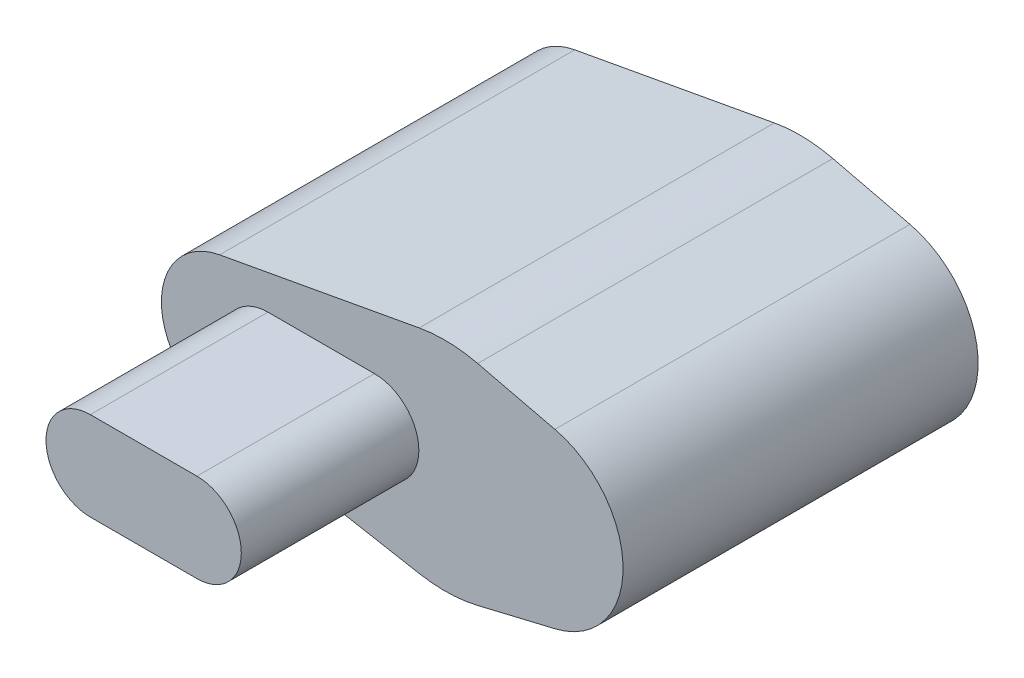
ISO-10303-21;
HEADER;
FILE_DESCRIPTION(('STEP AP214'),'2;1');
FILE_NAME('part.step','',(''),(''),'','','');
FILE_SCHEMA(('AUTOMOTIVE_DESIGN { 1 0 10303 214 1 1 1 1 }'));
ENDSEC;
DATA;
#1=APPLICATION_CONTEXT('core data for automotive mechanical design processes');
#2=APPLICATION_PROTOCOL_DEFINITION('international standard','automotive_design',2000,#1);
#3=PRODUCT_CONTEXT('',#1,'mechanical');
#4=PRODUCT('Part','Part','',(#3));
#5=PRODUCT_RELATED_PRODUCT_CATEGORY('part','',(#4));
#6=PRODUCT_DEFINITION_FORMATION('','',#4);
#7=PRODUCT_DEFINITION_CONTEXT('part definition',#1,'design');
#8=PRODUCT_DEFINITION('design','',#6,#7);
#9=PRODUCT_DEFINITION_SHAPE('','',#8);
#10=(LENGTH_UNIT() NAMED_UNIT(*) SI_UNIT(.MILLI.,.METRE.));
#11=(NAMED_UNIT(*) PLANE_ANGLE_UNIT() SI_UNIT($,.RADIAN.));
#12=(NAMED_UNIT(*) SI_UNIT($,.STERADIAN.) SOLID_ANGLE_UNIT());
#13=UNCERTAINTY_MEASURE_WITH_UNIT(LENGTH_MEASURE(1.E-05),#10,'distance_accuracy_value','');
#14=(GEOMETRIC_REPRESENTATION_CONTEXT(3) GLOBAL_UNCERTAINTY_ASSIGNED_CONTEXT((#13)) GLOBAL_UNIT_ASSIGNED_CONTEXT((#10,
#11,#12)) REPRESENTATION_CONTEXT('',''));
#15=CARTESIAN_POINT('',(0.,0.,0.));
#16=DIRECTION('',(0.,0.,1.));
#17=DIRECTION('',(1.,0.,0.));
#18=AXIS2_PLACEMENT_3D('',#15,#16,#17);
#19=CARTESIAN_POINT('',(-150.,0.,-16.));
#20=DIRECTION('',(0.,0.,-1.));
#21=DIRECTION('',(-1.,0.,0.));
#22=AXIS2_PLACEMENT_3D('',#19,#20,#21);
#23=PLANE('',#22);
#24=CARTESIAN_POINT('',(-150.,0.,-16.));
#25=DIRECTION('',(0.,0.,-1.));
#26=DIRECTION('',(-1.,0.,0.));
#27=AXIS2_PLACEMENT_3D('',#24,#25,#26);
#28=CIRCLE('',#27,28.);
#29=CARTESIAN_POINT('',(-178.,0.,-16.));
#30=VERTEX_POINT('',#29);
#31=EDGE_CURVE('E340',#30,#30,#28,.T.);
#32=ORIENTED_EDGE('',*,*,#31,.T.);
#33=EDGE_LOOP('',(#32));
#34=FACE_BOUND('',#33,.T.);
#35=CARTESIAN_POINT('',(-150.,0.,-16.));
#36=DIRECTION('',(0.,0.,-1.));
#37=DIRECTION('',(-1.,0.,0.));
#38=AXIS2_PLACEMENT_3D('',#35,#36,#37);
#39=CIRCLE('',#38,20.);
#40=CARTESIAN_POINT('',(-170.,0.,-16.));
#41=VERTEX_POINT('',#40);
#42=EDGE_CURVE('E331',#41,#41,#39,.T.);
#43=ORIENTED_EDGE('',*,*,#42,.F.);
#44=EDGE_LOOP('',(#43));
#45=FACE_BOUND('',#44,.T.);
#46=ADVANCED_FACE('F33',(#34,#45),#23,.T.);
#47=CARTESIAN_POINT('',(-80.,-224.819142690181,0.));
#48=DIRECTION('',(0.,0.,1.));
#49=DIRECTION('',(1.,0.,0.));
#50=AXIS2_PLACEMENT_3D('',#47,#48,#49);
#51=PLANE('',#50);
#52=DIRECTION('',(0.972650901363,0.232271875348144,0.));
#53=VECTOR('',#52,1.);
#54=CARTESIAN_POINT('',(-114.861405129302,-78.8351441067433,0.));
#55=LINE('',#54,#53);
#56=CARTESIAN_POINT('',(-31.8445005849701,-59.0104648954366,0.));
#57=VERTEX_POINT('',#56);
#58=CARTESIAN_POINT('',(11.6135937674072,-48.63254506815,0.));
#59=VERTEX_POINT('',#58);
#60=EDGE_CURVE('E173',#57,#59,#55,.T.);
#61=ORIENTED_EDGE('',*,*,#60,.F.);
#62=CARTESIAN_POINT('',(-50.4262506128216,18.8016072136034,0.));
#63=DIRECTION('',(0.,0.,1.));
#64=DIRECTION('',(1.,0.,0.));
#65=AXIS2_PLACEMENT_3D('',#62,#63,#64);
#66=CIRCLE('',#65,80.);
#67=CARTESIAN_POINT('',(-64.8139971783994,-59.8939628571745,0.));
#68=VERTEX_POINT('',#67);
#69=EDGE_CURVE('E193',#57,#68,#66,.F.);
#70=ORIENTED_EDGE('',*,*,#69,.T.);
#71=DIRECTION('',(-0.983694625884723,0.179846832069722,0.));
#72=VECTOR('',#71,1.);
#73=CARTESIAN_POINT('',(-50.331177516289,-62.541826500147,0.));
#74=LINE('',#73,#72);
#75=CARTESIAN_POINT('',(-177.193873282789,-39.347785035389,0.));
#76=VERTEX_POINT('',#75);
#77=EDGE_CURVE('E171',#68,#76,#74,.T.);
#78=ORIENTED_EDGE('',*,*,#77,.T.);
#79=CARTESIAN_POINT('',(-170.,0.,0.));
#80=DIRECTION('',(0.,0.,1.));
#81=DIRECTION('',(1.,0.,0.));
#82=AXIS2_PLACEMENT_3D('',#79,#80,#81);
#83=CIRCLE('',#82,40.);
#84=CARTESIAN_POINT('',(-177.193873282789,39.3477850353889,0.));
#85=VERTEX_POINT('',#84);
#86=EDGE_CURVE('E168',#85,#76,#83,.T.);
#87=ORIENTED_EDGE('',*,*,#86,.F.);
#88=DIRECTION('',(-0.983694625884723,-0.179846832069722,0.));
#89=VECTOR('',#88,1.);
#90=CARTESIAN_POINT('',(-129.878647990281,47.9983287647189,0.));
#91=LINE('',#90,#89);
#92=CARTESIAN_POINT('',(-64.8139971783996,59.8939628571745,0.));
#93=VERTEX_POINT('',#92);
#94=EDGE_CURVE('E145',#93,#85,#91,.T.);
#95=ORIENTED_EDGE('',*,*,#94,.F.);
#96=CARTESIAN_POINT('',(-50.4262506128218,-18.8016072136034,0.));
#97=DIRECTION('',(0.,0.,1.));
#98=DIRECTION('',(1.,0.,0.));
#99=AXIS2_PLACEMENT_3D('',#96,#97,#98);
#100=CIRCLE('',#99,80.);
#101=CARTESIAN_POINT('',(-31.8445005849702,59.0104648954366,0.));
#102=VERTEX_POINT('',#101);
#103=EDGE_CURVE('E191',#93,#102,#100,.F.);
#104=ORIENTED_EDGE('',*,*,#103,.T.);
#105=DIRECTION('',(0.972650901363,-0.232271875348144,0.));
#106=VECTOR('',#105,1.);
#107=CARTESIAN_POINT('',(-13.2793714834448,54.5770578565401,0.));
#108=LINE('',#107,#106);
#109=CARTESIAN_POINT('',(11.6135937674072,48.63254506815,0.));
#110=VERTEX_POINT('',#109);
#111=EDGE_CURVE('E143',#102,#110,#108,.T.);
#112=ORIENTED_EDGE('',*,*,#111,.T.);
#113=CARTESIAN_POINT('',(0.,0.,0.));
#114=DIRECTION('',(0.,0.,1.));
#115=DIRECTION('',(1.,0.,0.));
#116=AXIS2_PLACEMENT_3D('',#113,#114,#115);
#117=CIRCLE('',#116,50.);
#118=EDGE_CURVE('E154',#59,#110,#117,.T.);
#119=ORIENTED_EDGE('',*,*,#118,.F.);
#120=EDGE_LOOP('',(#61,#70,#78,#87,#95,#104,#112,#119));
#121=FACE_BOUND('',#120,.T.);
#122=CARTESIAN_POINT('',(0.,0.,0.));
#123=DIRECTION('',(0.,0.,-1.));
#124=DIRECTION('',(-1.,0.,0.));
#125=AXIS2_PLACEMENT_3D('',#122,#123,#124);
#126=CIRCLE('',#125,25.);
#127=CARTESIAN_POINT('',(-25.,0.,0.));
#128=VERTEX_POINT('',#127);
#129=EDGE_CURVE('E348',#128,#128,#126,.T.);
#130=ORIENTED_EDGE('',*,*,#129,.F.);
#131=EDGE_LOOP('',(#130));
#132=FACE_BOUND('',#131,.T.);
#133=CARTESIAN_POINT('',(-150.,0.,0.));
#134=DIRECTION('',(0.,0.,1.));
#135=DIRECTION('',(1.,0.,0.));
#136=AXIS2_PLACEMENT_3D('',#133,#134,#135);
#137=CIRCLE('',#136,25.);
#138=CARTESIAN_POINT('',(-125.,0.,0.));
#139=VERTEX_POINT('',#138);
#140=EDGE_CURVE('E41',#139,#139,#137,.F.);
#141=ORIENTED_EDGE('',*,*,#140,.F.);
#142=EDGE_LOOP('',(#141));
#143=FACE_BOUND('',#142,.T.);
#144=ADVANCED_FACE('F210',(#121,#132,#143),#51,.F.);
#145=CARTESIAN_POINT('',(-80.,-224.819142690181,200.));
#146=DIRECTION('',(0.,0.,1.));
#147=DIRECTION('',(1.,0.,0.));
#148=AXIS2_PLACEMENT_3D('',#145,#146,#147);
#149=PLANE('',#148);
#150=DIRECTION('',(-0.983694625884723,0.179846832069722,0.));
#151=VECTOR('',#150,1.);
#152=CARTESIAN_POINT('',(-50.331177516289,-62.541826500147,200.));
#153=LINE('',#152,#151);
#154=CARTESIAN_POINT('',(-64.8139971783994,-59.8939628571745,200.));
#155=VERTEX_POINT('',#154);
#156=CARTESIAN_POINT('',(-177.193873282789,-39.347785035389,200.));
#157=VERTEX_POINT('',#156);
#158=EDGE_CURVE('E159',#155,#157,#153,.T.);
#159=ORIENTED_EDGE('',*,*,#158,.F.);
#160=CARTESIAN_POINT('',(-50.4262506128216,18.8016072136034,200.));
#161=DIRECTION('',(0.,0.,1.));
#162=DIRECTION('',(1.,0.,0.));
#163=AXIS2_PLACEMENT_3D('',#160,#161,#162);
#164=CIRCLE('',#163,80.);
#165=CARTESIAN_POINT('',(-31.8445005849701,-59.0104648954366,200.));
#166=VERTEX_POINT('',#165);
#167=EDGE_CURVE('E199',#155,#166,#164,.T.);
#168=ORIENTED_EDGE('',*,*,#167,.T.);
#169=DIRECTION('',(0.972650901363,0.232271875348144,0.));
#170=VECTOR('',#169,1.);
#171=CARTESIAN_POINT('',(-114.861405129302,-78.8351441067433,200.));
#172=LINE('',#171,#170);
#173=CARTESIAN_POINT('',(11.6135937674072,-48.63254506815,200.));
#174=VERTEX_POINT('',#173);
#175=EDGE_CURVE('E161',#166,#174,#172,.T.);
#176=ORIENTED_EDGE('',*,*,#175,.T.);
#177=CARTESIAN_POINT('',(0.,0.,200.));
#178=DIRECTION('',(0.,0.,1.));
#179=DIRECTION('',(1.,0.,0.));
#180=AXIS2_PLACEMENT_3D('',#177,#178,#179);
#181=CIRCLE('',#180,50.);
#182=CARTESIAN_POINT('',(11.6135937674072,48.63254506815,200.));
#183=VERTEX_POINT('',#182);
#184=EDGE_CURVE('E163',#174,#183,#181,.T.);
#185=ORIENTED_EDGE('',*,*,#184,.T.);
#186=DIRECTION('',(0.972650901363,-0.232271875348144,0.));
#187=VECTOR('',#186,1.);
#188=CARTESIAN_POINT('',(-13.2793714834448,54.5770578565401,200.));
#189=LINE('',#188,#187);
#190=CARTESIAN_POINT('',(-31.8445005849702,59.0104648954366,200.));
#191=VERTEX_POINT('',#190);
#192=EDGE_CURVE('E151',#191,#183,#189,.T.);
#193=ORIENTED_EDGE('',*,*,#192,.F.);
#194=CARTESIAN_POINT('',(-50.4262506128218,-18.8016072136034,200.));
#195=DIRECTION('',(0.,0.,1.));
#196=DIRECTION('',(1.,0.,0.));
#197=AXIS2_PLACEMENT_3D('',#194,#195,#196);
#198=CIRCLE('',#197,80.);
#199=CARTESIAN_POINT('',(-64.8139971783996,59.8939628571745,200.));
#200=VERTEX_POINT('',#199);
#201=EDGE_CURVE('E197',#191,#200,#198,.T.);
#202=ORIENTED_EDGE('',*,*,#201,.T.);
#203=DIRECTION('',(-0.983694625884723,-0.179846832069722,0.));
#204=VECTOR('',#203,1.);
#205=CARTESIAN_POINT('',(-129.878647990281,47.9983287647189,200.));
#206=LINE('',#205,#204);
#207=CARTESIAN_POINT('',(-177.193873282789,39.3477850353889,200.));
#208=VERTEX_POINT('',#207);
#209=EDGE_CURVE('E153',#200,#208,#206,.T.);
#210=ORIENTED_EDGE('',*,*,#209,.T.);
#211=CARTESIAN_POINT('',(-170.,0.,200.));
#212=DIRECTION('',(0.,0.,1.));
#213=DIRECTION('',(1.,0.,0.));
#214=AXIS2_PLACEMENT_3D('',#211,#212,#213);
#215=CIRCLE('',#214,40.);
#216=EDGE_CURVE('E156',#208,#157,#215,.T.);
#217=ORIENTED_EDGE('',*,*,#216,.T.);
#218=EDGE_LOOP('',(#159,#168,#176,#185,#193,#202,#210,#217));
#219=FACE_BOUND('',#218,.T.);
#220=DIRECTION('',(1.,0.,0.));
#221=VECTOR('',#220,1.);
#222=CARTESIAN_POINT('',(-80.0000000000002,-25.,200.));
#223=LINE('',#222,#221);
#224=CARTESIAN_POINT('',(-150.,-25.0000000000001,200.));
#225=VERTEX_POINT('',#224);
#226=CARTESIAN_POINT('',(-90.,-25.,200.));
#227=VERTEX_POINT('',#226);
#228=EDGE_CURVE('E48',#225,#227,#223,.T.);
#229=ORIENTED_EDGE('',*,*,#228,.F.);
#230=CARTESIAN_POINT('',(-150.,0.,200.));
#231=DIRECTION('',(0.,0.,1.));
#232=DIRECTION('',(1.,0.,0.));
#233=AXIS2_PLACEMENT_3D('',#230,#231,#232);
#234=CIRCLE('',#233,25.);
#235=CARTESIAN_POINT('',(-150.,25.,200.));
#236=VERTEX_POINT('',#235);
#237=EDGE_CURVE('E142',#236,#225,#234,.T.);
#238=ORIENTED_EDGE('',*,*,#237,.F.);
#239=DIRECTION('',(1.,0.,0.));
#240=VECTOR('',#239,1.);
#241=CARTESIAN_POINT('',(-80.,25.,200.));
#242=LINE('',#241,#240);
#243=CARTESIAN_POINT('',(-90.,25.,200.));
#244=VERTEX_POINT('',#243);
#245=EDGE_CURVE('E139',#236,#244,#242,.T.);
#246=ORIENTED_EDGE('',*,*,#245,.T.);
#247=CARTESIAN_POINT('',(-90.,0.,200.));
#248=DIRECTION('',(0.,0.,1.));
#249=DIRECTION('',(1.,0.,0.));
#250=AXIS2_PLACEMENT_3D('',#247,#248,#249);
#251=CIRCLE('',#250,25.);
#252=EDGE_CURVE('E53',#227,#244,#251,.T.);
#253=ORIENTED_EDGE('',*,*,#252,.F.);
#254=EDGE_LOOP('',(#229,#238,#246,#253));
#255=FACE_BOUND('',#254,.T.);
#256=ADVANCED_FACE('F212',(#219,#255),#149,.T.);
#257=CARTESIAN_POINT('',(-13.2793714834448,54.5770578565401,200.));
#258=DIRECTION('',(0.232271875348144,0.972650901363,0.));
#259=DIRECTION('',(-0.972650901363,0.232271875348144,0.));
#260=AXIS2_PLACEMENT_3D('',#257,#258,#259);
#261=PLANE('',#260);
#262=ORIENTED_EDGE('',*,*,#111,.F.);
#263=DIRECTION('',(0.,0.,-1.));
#264=VECTOR('',#263,1.);
#265=CARTESIAN_POINT('',(-31.8445005849702,59.0104648954366,200.));
#266=LINE('',#265,#264);
#267=EDGE_CURVE('E204',#102,#191,#266,.F.);
#268=ORIENTED_EDGE('',*,*,#267,.T.);
#269=ORIENTED_EDGE('',*,*,#192,.T.);
#270=DIRECTION('',(0.,0.,-1.));
#271=VECTOR('',#270,1.);
#272=CARTESIAN_POINT('',(11.6135937674072,48.63254506815,200.));
#273=LINE('',#272,#271);
#274=EDGE_CURVE('E165',#183,#110,#273,.T.);
#275=ORIENTED_EDGE('',*,*,#274,.T.);
#276=EDGE_LOOP('',(#262,#268,#269,#275));
#277=FACE_BOUND('',#276,.T.);
#278=ADVANCED_FACE('F219',(#277),#261,.T.);
#279=CARTESIAN_POINT('',(-129.878647990281,47.9983287647189,200.));
#280=DIRECTION('',(0.179846832069722,-0.983694625884723,0.));
#281=DIRECTION('',(0.983694625884723,0.179846832069722,0.));
#282=AXIS2_PLACEMENT_3D('',#279,#280,#281);
#283=PLANE('',#282);
#284=ORIENTED_EDGE('',*,*,#209,.F.);
#285=DIRECTION('',(0.,0.,-1.));
#286=VECTOR('',#285,1.);
#287=CARTESIAN_POINT('',(-64.8139971783996,59.8939628571745,0.));
#288=LINE('',#287,#286);
#289=EDGE_CURVE('E201',#200,#93,#288,.T.);
#290=ORIENTED_EDGE('',*,*,#289,.T.);
#291=ORIENTED_EDGE('',*,*,#94,.T.);
#292=DIRECTION('',(0.,0.,-1.));
#293=VECTOR('',#292,1.);
#294=CARTESIAN_POINT('',(-177.193873282789,39.3477850353889,200.));
#295=LINE('',#294,#293);
#296=EDGE_CURVE('E185',#208,#85,#295,.T.);
#297=ORIENTED_EDGE('',*,*,#296,.F.);
#298=EDGE_LOOP('',(#284,#290,#291,#297));
#299=FACE_BOUND('',#298,.T.);
#300=ADVANCED_FACE('F244',(#299),#283,.F.);
#301=CARTESIAN_POINT('',(-170.,0.,200.));
#302=DIRECTION('',(0.,0.,-1.));
#303=DIRECTION('',(-1.,0.,0.));
#304=AXIS2_PLACEMENT_3D('',#301,#302,#303);
#305=CYLINDRICAL_SURFACE('',#304,40.);
#306=ORIENTED_EDGE('',*,*,#86,.T.);
#307=DIRECTION('',(0.,0.,-1.));
#308=VECTOR('',#307,1.);
#309=CARTESIAN_POINT('',(-177.193873282789,-39.347785035389,200.));
#310=LINE('',#309,#308);
#311=EDGE_CURVE('E182',#157,#76,#310,.T.);
#312=ORIENTED_EDGE('',*,*,#311,.F.);
#313=ORIENTED_EDGE('',*,*,#216,.F.);
#314=ORIENTED_EDGE('',*,*,#296,.T.);
#315=EDGE_LOOP('',(#306,#312,#313,#314));
#316=FACE_BOUND('',#315,.T.);
#317=ADVANCED_FACE('F240',(#316),#305,.T.);
#318=CARTESIAN_POINT('',(-50.331177516289,-62.541826500147,200.));
#319=DIRECTION('',(-0.179846832069722,-0.983694625884723,0.));
#320=DIRECTION('',(0.983694625884723,-0.179846832069722,0.));
#321=AXIS2_PLACEMENT_3D('',#318,#319,#320);
#322=PLANE('',#321);
#323=ORIENTED_EDGE('',*,*,#77,.F.);
#324=DIRECTION('',(0.,0.,-1.));
#325=VECTOR('',#324,1.);
#326=CARTESIAN_POINT('',(-64.8139971783994,-59.8939628571745,200.));
#327=LINE('',#326,#325);
#328=EDGE_CURVE('E195',#68,#155,#327,.F.);
#329=ORIENTED_EDGE('',*,*,#328,.T.);
#330=ORIENTED_EDGE('',*,*,#158,.T.);
#331=ORIENTED_EDGE('',*,*,#311,.T.);
#332=EDGE_LOOP('',(#323,#329,#330,#331));
#333=FACE_BOUND('',#332,.T.);
#334=ADVANCED_FACE('F236',(#333),#322,.T.);
#335=CARTESIAN_POINT('',(-114.861405129302,-78.8351441067433,200.));
#336=DIRECTION('',(-0.232271875348144,0.972650901363,0.));
#337=DIRECTION('',(-0.972650901363,-0.232271875348144,0.));
#338=AXIS2_PLACEMENT_3D('',#335,#336,#337);
#339=PLANE('',#338);
#340=ORIENTED_EDGE('',*,*,#175,.F.);
#341=DIRECTION('',(0.,0.,-1.));
#342=VECTOR('',#341,1.);
#343=CARTESIAN_POINT('',(-31.8445005849701,-59.0104648954366,0.));
#344=LINE('',#343,#342);
#345=EDGE_CURVE('E188',#166,#57,#344,.T.);
#346=ORIENTED_EDGE('',*,*,#345,.T.);
#347=ORIENTED_EDGE('',*,*,#60,.T.);
#348=DIRECTION('',(0.,0.,-1.));
#349=VECTOR('',#348,1.);
#350=CARTESIAN_POINT('',(11.6135937674072,-48.63254506815,200.));
#351=LINE('',#350,#349);
#352=EDGE_CURVE('E179',#174,#59,#351,.T.);
#353=ORIENTED_EDGE('',*,*,#352,.F.);
#354=EDGE_LOOP('',(#340,#346,#347,#353));
#355=FACE_BOUND('',#354,.T.);
#356=ADVANCED_FACE('F232',(#355),#339,.F.);
#357=CARTESIAN_POINT('',(0.,0.,200.));
#358=DIRECTION('',(0.,0.,-1.));
#359=DIRECTION('',(-1.,0.,0.));
#360=AXIS2_PLACEMENT_3D('',#357,#358,#359);
#361=CYLINDRICAL_SURFACE('',#360,50.);
#362=ORIENTED_EDGE('',*,*,#118,.T.);
#363=ORIENTED_EDGE('',*,*,#274,.F.);
#364=ORIENTED_EDGE('',*,*,#184,.F.);
#365=ORIENTED_EDGE('',*,*,#352,.T.);
#366=EDGE_LOOP('',(#362,#363,#364,#365));
#367=FACE_BOUND('',#366,.T.);
#368=ADVANCED_FACE('F228',(#367),#361,.T.);
#369=CARTESIAN_POINT('',(-50.4262506128216,18.8016072136034,200.));
#370=DIRECTION('',(0.,0.,1.));
#371=DIRECTION('',(1.,0.,0.));
#372=AXIS2_PLACEMENT_3D('',#369,#370,#371);
#373=CYLINDRICAL_SURFACE('',#372,80.);
#374=ORIENTED_EDGE('',*,*,#167,.F.);
#375=ORIENTED_EDGE('',*,*,#328,.F.);
#376=ORIENTED_EDGE('',*,*,#69,.F.);
#377=ORIENTED_EDGE('',*,*,#345,.F.);
#378=EDGE_LOOP('',(#374,#375,#376,#377));
#379=FACE_BOUND('',#378,.T.);
#380=ADVANCED_FACE('F231',(#379),#373,.T.);
#381=CARTESIAN_POINT('',(-50.4262506128218,-18.8016072136034,200.));
#382=DIRECTION('',(0.,0.,1.));
#383=DIRECTION('',(1.,0.,0.));
#384=AXIS2_PLACEMENT_3D('',#381,#382,#383);
#385=CYLINDRICAL_SURFACE('',#384,80.);
#386=ORIENTED_EDGE('',*,*,#201,.F.);
#387=ORIENTED_EDGE('',*,*,#267,.F.);
#388=ORIENTED_EDGE('',*,*,#103,.F.);
#389=ORIENTED_EDGE('',*,*,#289,.F.);
#390=EDGE_LOOP('',(#386,#387,#388,#389));
#391=FACE_BOUND('',#390,.T.);
#392=ADVANCED_FACE('F253',(#391),#385,.T.);
#393=CARTESIAN_POINT('',(-150.,0.,300.));
#394=DIRECTION('',(0.,0.,-1.));
#395=DIRECTION('',(-1.,0.,0.));
#396=AXIS2_PLACEMENT_3D('',#393,#394,#395);
#397=CYLINDRICAL_SURFACE('',#396,25.);
#398=ORIENTED_EDGE('',*,*,#237,.T.);
#399=DIRECTION('',(0.,0.,-1.));
#400=VECTOR('',#399,1.);
#401=CARTESIAN_POINT('',(-150.,-25.,300.));
#402=LINE('',#401,#400);
#403=CARTESIAN_POINT('',(-150.,-25.,300.));
#404=VERTEX_POINT('',#403);
#405=EDGE_CURVE('E123',#404,#225,#402,.T.);
#406=ORIENTED_EDGE('',*,*,#405,.F.);
#407=CARTESIAN_POINT('',(-150.,0.,300.));
#408=DIRECTION('',(0.,0.,1.));
#409=DIRECTION('',(1.,0.,0.));
#410=AXIS2_PLACEMENT_3D('',#407,#408,#409);
#411=CIRCLE('',#410,25.);
#412=CARTESIAN_POINT('',(-150.,25.,300.));
#413=VERTEX_POINT('',#412);
#414=EDGE_CURVE('E130',#413,#404,#411,.T.);
#415=ORIENTED_EDGE('',*,*,#414,.F.);
#416=DIRECTION('',(0.,0.,-1.));
#417=VECTOR('',#416,1.);
#418=CARTESIAN_POINT('',(-150.,25.,300.));
#419=LINE('',#418,#417);
#420=EDGE_CURVE('E356',#413,#236,#419,.T.);
#421=ORIENTED_EDGE('',*,*,#420,.T.);
#422=EDGE_LOOP('',(#398,#406,#415,#421));
#423=FACE_BOUND('',#422,.T.);
#424=ADVANCED_FACE('F141',(#423),#397,.T.);
#425=CARTESIAN_POINT('',(-80.0000000000002,-25.,300.));
#426=DIRECTION('',(0.,1.,0.));
#427=DIRECTION('',(-1.,0.,0.));
#428=AXIS2_PLACEMENT_3D('',#425,#426,#427);
#429=PLANE('',#428);
#430=ORIENTED_EDGE('',*,*,#228,.T.);
#431=DIRECTION('',(0.,0.,-1.));
#432=VECTOR('',#431,1.);
#433=CARTESIAN_POINT('',(-90.,-25.,300.));
#434=LINE('',#433,#432);
#435=CARTESIAN_POINT('',(-90.,-25.,300.));
#436=VERTEX_POINT('',#435);
#437=EDGE_CURVE('E126',#436,#227,#434,.T.);
#438=ORIENTED_EDGE('',*,*,#437,.F.);
#439=DIRECTION('',(1.,0.,0.));
#440=VECTOR('',#439,1.);
#441=CARTESIAN_POINT('',(-80.0000000000002,-25.,300.));
#442=LINE('',#441,#440);
#443=EDGE_CURVE('E119',#404,#436,#442,.T.);
#444=ORIENTED_EDGE('',*,*,#443,.F.);
#445=ORIENTED_EDGE('',*,*,#405,.T.);
#446=EDGE_LOOP('',(#430,#438,#444,#445));
#447=FACE_BOUND('',#446,.T.);
#448=ADVANCED_FACE('F121',(#447),#429,.F.);
#449=CARTESIAN_POINT('',(-90.,0.,300.));
#450=DIRECTION('',(0.,0.,-1.));
#451=DIRECTION('',(-1.,0.,0.));
#452=AXIS2_PLACEMENT_3D('',#449,#450,#451);
#453=CYLINDRICAL_SURFACE('',#452,25.);
#454=ORIENTED_EDGE('',*,*,#252,.T.);
#455=DIRECTION('',(0.,0.,-1.));
#456=VECTOR('',#455,1.);
#457=CARTESIAN_POINT('',(-90.,25.,300.));
#458=LINE('',#457,#456);
#459=CARTESIAN_POINT('',(-90.,25.,300.));
#460=VERTEX_POINT('',#459);
#461=EDGE_CURVE('E147',#460,#244,#458,.T.);
#462=ORIENTED_EDGE('',*,*,#461,.F.);
#463=CARTESIAN_POINT('',(-90.,0.,300.));
#464=DIRECTION('',(0.,0.,1.));
#465=DIRECTION('',(1.,0.,0.));
#466=AXIS2_PLACEMENT_3D('',#463,#464,#465);
#467=CIRCLE('',#466,25.);
#468=EDGE_CURVE('E129',#436,#460,#467,.T.);
#469=ORIENTED_EDGE('',*,*,#468,.F.);
#470=ORIENTED_EDGE('',*,*,#437,.T.);
#471=EDGE_LOOP('',(#454,#462,#469,#470));
#472=FACE_BOUND('',#471,.T.);
#473=ADVANCED_FACE('F284',(#472),#453,.T.);
#474=CARTESIAN_POINT('',(-80.,25.,300.));
#475=DIRECTION('',(0.,1.,0.));
#476=DIRECTION('',(0.,0.,1.));
#477=AXIS2_PLACEMENT_3D('',#474,#475,#476);
#478=PLANE('',#477);
#479=ORIENTED_EDGE('',*,*,#245,.F.);
#480=ORIENTED_EDGE('',*,*,#420,.F.);
#481=DIRECTION('',(1.,0.,0.));
#482=VECTOR('',#481,1.);
#483=CARTESIAN_POINT('',(-80.,25.,300.));
#484=LINE('',#483,#482);
#485=EDGE_CURVE('E136',#413,#460,#484,.T.);
#486=ORIENTED_EDGE('',*,*,#485,.T.);
#487=ORIENTED_EDGE('',*,*,#461,.T.);
#488=EDGE_LOOP('',(#479,#480,#486,#487));
#489=FACE_BOUND('',#488,.T.);
#490=ADVANCED_FACE('F289',(#489),#478,.T.);
#491=CARTESIAN_POINT('',(-80.,-213.394405996283,300.));
#492=DIRECTION('',(0.,0.,1.));
#493=DIRECTION('',(1.,0.,0.));
#494=AXIS2_PLACEMENT_3D('',#491,#492,#493);
#495=PLANE('',#494);
#496=ORIENTED_EDGE('',*,*,#414,.T.);
#497=ORIENTED_EDGE('',*,*,#443,.T.);
#498=ORIENTED_EDGE('',*,*,#468,.T.);
#499=ORIENTED_EDGE('',*,*,#485,.F.);
#500=EDGE_LOOP('',(#496,#497,#498,#499));
#501=FACE_BOUND('',#500,.T.);
#502=ADVANCED_FACE('F134',(#501),#495,.T.);
#503=CARTESIAN_POINT('',(0.,0.,160.));
#504=DIRECTION('',(0.,0.,-1.));
#505=DIRECTION('',(-1.,0.,0.));
#506=AXIS2_PLACEMENT_3D('',#503,#504,#505);
#507=CYLINDRICAL_SURFACE('',#506,25.);
#508=CARTESIAN_POINT('',(0.,0.,160.));
#509=DIRECTION('',(0.,0.,-1.));
#510=DIRECTION('',(-1.,0.,0.));
#511=AXIS2_PLACEMENT_3D('',#508,#509,#510);
#512=CIRCLE('',#511,25.);
#513=CARTESIAN_POINT('',(-25.,0.,160.));
#514=VERTEX_POINT('',#513);
#515=EDGE_CURVE('E349',#514,#514,#512,.T.);
#516=ORIENTED_EDGE('',*,*,#515,.F.);
#517=EDGE_LOOP('',(#516));
#518=FACE_BOUND('',#517,.T.);
#519=ORIENTED_EDGE('',*,*,#129,.T.);
#520=EDGE_LOOP('',(#519));
#521=FACE_BOUND('',#520,.T.);
#522=ADVANCED_FACE('F296',(#518,#521),#507,.F.);
#523=CARTESIAN_POINT('',(0.,0.,160.));
#524=DIRECTION('',(0.,0.,-1.));
#525=DIRECTION('',(-1.,0.,0.));
#526=AXIS2_PLACEMENT_3D('',#523,#524,#525);
#527=PLANE('',#526);
#528=ORIENTED_EDGE('',*,*,#515,.T.);
#529=EDGE_LOOP('',(#528));
#530=FACE_BOUND('',#529,.T.);
#531=ADVANCED_FACE('F299',(#530),#527,.T.);
#532=CARTESIAN_POINT('',(-150.,0.,-12.));
#533=DIRECTION('',(0.,0.,1.));
#534=DIRECTION('',(1.,0.,0.));
#535=AXIS2_PLACEMENT_3D('',#532,#533,#534);
#536=CYLINDRICAL_SURFACE('',#535,25.);
#537=CARTESIAN_POINT('',(-150.,0.,-12.));
#538=DIRECTION('',(0.,0.,-1.));
#539=DIRECTION('',(-1.,0.,0.));
#540=AXIS2_PLACEMENT_3D('',#537,#538,#539);
#541=CIRCLE('',#540,25.);
#542=CARTESIAN_POINT('',(-175.,0.,-12.));
#543=VERTEX_POINT('',#542);
#544=EDGE_CURVE('E343',#543,#543,#541,.T.);
#545=ORIENTED_EDGE('',*,*,#544,.F.);
#546=EDGE_LOOP('',(#545));
#547=FACE_BOUND('',#546,.T.);
#548=ORIENTED_EDGE('',*,*,#140,.T.);
#549=EDGE_LOOP('',(#548));
#550=FACE_BOUND('',#549,.T.);
#551=ADVANCED_FACE('F208',(#547,#550),#536,.T.);
#552=CARTESIAN_POINT('',(-150.,0.,-12.));
#553=DIRECTION('',(0.,0.,-1.));
#554=DIRECTION('',(-1.,0.,0.));
#555=AXIS2_PLACEMENT_3D('',#552,#553,#554);
#556=PLANE('',#555);
#557=CARTESIAN_POINT('',(-150.,0.,-12.));
#558=DIRECTION('',(0.,0.,-1.));
#559=DIRECTION('',(-1.,0.,0.));
#560=AXIS2_PLACEMENT_3D('',#557,#558,#559);
#561=CIRCLE('',#560,28.);
#562=CARTESIAN_POINT('',(-178.,0.,-12.));
#563=VERTEX_POINT('',#562);
#564=EDGE_CURVE('E335',#563,#563,#561,.T.);
#565=ORIENTED_EDGE('',*,*,#564,.F.);
#566=EDGE_LOOP('',(#565));
#567=FACE_BOUND('',#566,.T.);
#568=ORIENTED_EDGE('',*,*,#544,.T.);
#569=EDGE_LOOP('',(#568));
#570=FACE_BOUND('',#569,.T.);
#571=ADVANCED_FACE('F306',(#567,#570),#556,.F.);
#572=CARTESIAN_POINT('',(-150.,0.,-16.));
#573=DIRECTION('',(0.,0.,1.));
#574=DIRECTION('',(1.,0.,0.));
#575=AXIS2_PLACEMENT_3D('',#572,#573,#574);
#576=CYLINDRICAL_SURFACE('',#575,28.);
#577=ORIENTED_EDGE('',*,*,#31,.F.);
#578=EDGE_LOOP('',(#577));
#579=FACE_BOUND('',#578,.T.);
#580=ORIENTED_EDGE('',*,*,#564,.T.);
#581=EDGE_LOOP('',(#580));
#582=FACE_BOUND('',#581,.T.);
#583=ADVANCED_FACE('F308',(#579,#582),#576,.T.);
#584=CARTESIAN_POINT('',(-150.,0.,-26.));
#585=DIRECTION('',(0.,0.,-1.));
#586=DIRECTION('',(-1.,0.,0.));
#587=AXIS2_PLACEMENT_3D('',#584,#585,#586);
#588=PLANE('',#587);
#589=CARTESIAN_POINT('',(-150.,0.,-26.));
#590=DIRECTION('',(0.,0.,-1.));
#591=DIRECTION('',(-1.,0.,0.));
#592=AXIS2_PLACEMENT_3D('',#589,#590,#591);
#593=CIRCLE('',#592,7.00000000000001);
#594=CARTESIAN_POINT('',(-157.,0.,-26.));
#595=VERTEX_POINT('',#594);
#596=EDGE_CURVE('E332',#595,#595,#593,.T.);
#597=ORIENTED_EDGE('',*,*,#596,.F.);
#598=EDGE_LOOP('',(#597));
#599=FACE_BOUND('',#598,.T.);
#600=CARTESIAN_POINT('',(-150.,0.,-26.));
#601=DIRECTION('',(0.,0.,-1.));
#602=DIRECTION('',(-1.,0.,0.));
#603=AXIS2_PLACEMENT_3D('',#600,#601,#602);
#604=CIRCLE('',#603,15.);
#605=CARTESIAN_POINT('',(-165.,0.,-26.));
#606=VERTEX_POINT('',#605);
#607=EDGE_CURVE('E11',#606,#606,#604,.T.);
#608=ORIENTED_EDGE('',*,*,#607,.T.);
#609=EDGE_LOOP('',(#608));
#610=FACE_BOUND('',#609,.T.);
#611=ADVANCED_FACE('F311',(#599,#610),#588,.T.);
#612=CARTESIAN_POINT('',(-150.,0.,-26.));
#613=DIRECTION('',(0.,0.,1.));
#614=DIRECTION('',(1.,0.,0.));
#615=AXIS2_PLACEMENT_3D('',#612,#613,#614);
#616=CONICAL_SURFACE('',#615,15.,0.463647609000806);
#617=ORIENTED_EDGE('',*,*,#42,.T.);
#618=EDGE_LOOP('',(#617));
#619=FACE_BOUND('',#618,.T.);
#620=ORIENTED_EDGE('',*,*,#607,.F.);
#621=EDGE_LOOP('',(#620));
#622=FACE_BOUND('',#621,.T.);
#623=ADVANCED_FACE('F35',(#619,#622),#616,.T.);
#624=CARTESIAN_POINT('',(-150.,0.,174.));
#625=DIRECTION('',(0.,0.,-1.));
#626=DIRECTION('',(-1.,0.,0.));
#627=AXIS2_PLACEMENT_3D('',#624,#625,#626);
#628=CYLINDRICAL_SURFACE('',#627,7.00000000000001);
#629=CARTESIAN_POINT('',(-150.,0.,174.));
#630=DIRECTION('',(0.,0.,-1.));
#631=DIRECTION('',(-1.,0.,0.));
#632=AXIS2_PLACEMENT_3D('',#629,#630,#631);
#633=CIRCLE('',#632,7.00000000000001);
#634=CARTESIAN_POINT('',(-157.,0.,174.));
#635=VERTEX_POINT('',#634);
#636=EDGE_CURVE('E330',#635,#635,#633,.T.);
#637=ORIENTED_EDGE('',*,*,#636,.F.);
#638=EDGE_LOOP('',(#637));
#639=FACE_BOUND('',#638,.T.);
#640=ORIENTED_EDGE('',*,*,#596,.T.);
#641=EDGE_LOOP('',(#640));
#642=FACE_BOUND('',#641,.T.);
#643=ADVANCED_FACE('F319',(#639,#642),#628,.F.);
#644=CARTESIAN_POINT('',(-150.,0.,174.));
#645=DIRECTION('',(0.,0.,-1.));
#646=DIRECTION('',(-1.,0.,0.));
#647=AXIS2_PLACEMENT_3D('',#644,#645,#646);
#648=PLANE('',#647);
#649=ORIENTED_EDGE('',*,*,#636,.T.);
#650=EDGE_LOOP('',(#649));
#651=FACE_BOUND('',#650,.T.);
#652=ADVANCED_FACE('F322',(#651),#648,.T.);
#653=CLOSED_SHELL('',(#46,#144,#256,#278,#300,#317,#334,#356,#368,#380,#392,#424,#448,#473,#490,
#502,#522,#531,#551,#571,#583,#611,#623,#643,#652));
#654=MANIFOLD_SOLID_BREP('B2',#653);
#655=ADVANCED_BREP_SHAPE_REPRESENTATION('',(#18,#654),#14);
#656=SHAPE_DEFINITION_REPRESENTATION(#9,#655);
ENDSEC;
END-ISO-10303-21;
